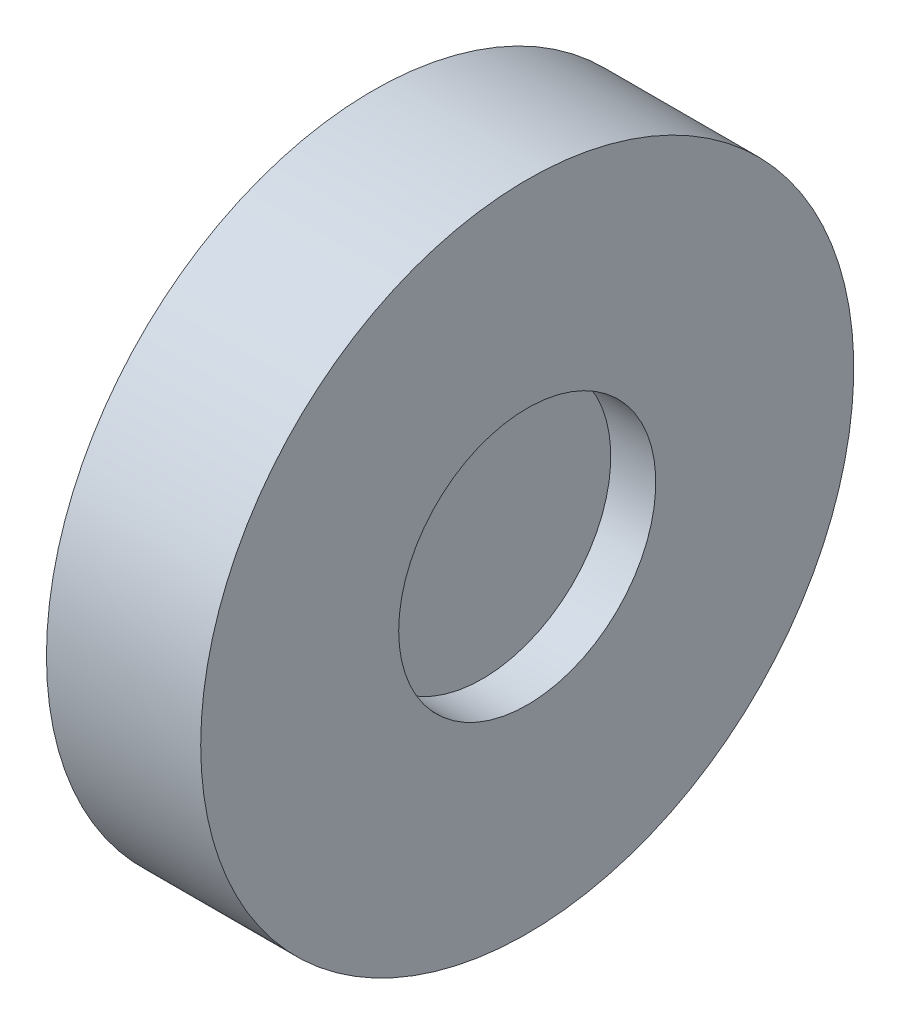
ISO-10303-21;
HEADER;
FILE_DESCRIPTION(('STEP AP214'),'2;1');
FILE_NAME('part.step','',(''),(''),'','','');
FILE_SCHEMA(('AUTOMOTIVE_DESIGN { 1 0 10303 214 1 1 1 1 }'));
ENDSEC;
DATA;
#1=APPLICATION_CONTEXT('core data for automotive mechanical design processes');
#2=APPLICATION_PROTOCOL_DEFINITION('international standard','automotive_design',2000,#1);
#3=PRODUCT_CONTEXT('',#1,'mechanical');
#4=PRODUCT('Part','Part','',(#3));
#5=PRODUCT_RELATED_PRODUCT_CATEGORY('part','',(#4));
#6=PRODUCT_DEFINITION_FORMATION('','',#4);
#7=PRODUCT_DEFINITION_CONTEXT('part definition',#1,'design');
#8=PRODUCT_DEFINITION('design','',#6,#7);
#9=PRODUCT_DEFINITION_SHAPE('','',#8);
#10=(LENGTH_UNIT() NAMED_UNIT(*) SI_UNIT(.MILLI.,.METRE.));
#11=(NAMED_UNIT(*) PLANE_ANGLE_UNIT() SI_UNIT($,.RADIAN.));
#12=(NAMED_UNIT(*) SI_UNIT($,.STERADIAN.) SOLID_ANGLE_UNIT());
#13=UNCERTAINTY_MEASURE_WITH_UNIT(LENGTH_MEASURE(1.E-05),#10,'distance_accuracy_value','');
#14=(GEOMETRIC_REPRESENTATION_CONTEXT(3) GLOBAL_UNCERTAINTY_ASSIGNED_CONTEXT((#13)) GLOBAL_UNIT_ASSIGNED_CONTEXT((#10,
#11,#12)) REPRESENTATION_CONTEXT('',''));
#15=CARTESIAN_POINT('',(0.,0.,0.));
#16=DIRECTION('',(0.,0.,1.));
#17=DIRECTION('',(1.,0.,0.));
#18=AXIS2_PLACEMENT_3D('',#15,#16,#17);
#19=CARTESIAN_POINT('',(1.25,5.,0.));
#20=DIRECTION('',(-1.,0.,0.));
#21=DIRECTION('',(0.,0.,1.));
#22=AXIS2_PLACEMENT_3D('',#19,#20,#21);
#23=PLANE('',#22);
#24=CARTESIAN_POINT('',(1.25,0.,0.));
#25=DIRECTION('',(-1.,0.,0.));
#26=DIRECTION('',(0.,0.,1.));
#27=AXIS2_PLACEMENT_3D('',#24,#25,#26);
#28=CIRCLE('',#27,5.);
#29=CARTESIAN_POINT('',(1.25,0.,5.));
#30=VERTEX_POINT('',#29);
#31=EDGE_CURVE('E10',#30,#30,#28,.T.);
#32=ORIENTED_EDGE('',*,*,#31,.F.);
#33=EDGE_LOOP('',(#32));
#34=FACE_BOUND('',#33,.T.);
#35=ADVANCED_FACE('F37',(#34),#23,.F.);
#36=CARTESIAN_POINT('',(-1.61421241885762,0.,0.));
#37=DIRECTION('',(-1.,0.,0.));
#38=DIRECTION('',(0.,0.,1.));
#39=AXIS2_PLACEMENT_3D('',#36,#37,#38);
#40=CYLINDRICAL_SURFACE('',#39,5.);
#41=CARTESIAN_POINT('',(3.,0.,0.));
#42=DIRECTION('',(-1.,0.,0.));
#43=DIRECTION('',(0.,0.,1.));
#44=AXIS2_PLACEMENT_3D('',#41,#42,#43);
#45=CIRCLE('',#44,5.);
#46=CARTESIAN_POINT('',(3.,0.,5.));
#47=VERTEX_POINT('',#46);
#48=EDGE_CURVE('E60',#47,#47,#45,.T.);
#49=ORIENTED_EDGE('',*,*,#48,.F.);
#50=EDGE_LOOP('',(#49));
#51=FACE_BOUND('',#50,.T.);
#52=ORIENTED_EDGE('',*,*,#31,.T.);
#53=EDGE_LOOP('',(#52));
#54=FACE_BOUND('',#53,.T.);
#55=ADVANCED_FACE('F90',(#51,#54),#40,.F.);
#56=CARTESIAN_POINT('',(-3.,0.,0.));
#57=DIRECTION('',(-1.,0.,0.));
#58=DIRECTION('',(0.,0.,1.));
#59=AXIS2_PLACEMENT_3D('',#56,#57,#58);
#60=CIRCLE('',#59,5.);
#61=CARTESIAN_POINT('',(-3.,0.,5.));
#62=VERTEX_POINT('',#61);
#63=EDGE_CURVE('E64',#62,#62,#60,.T.);
#64=ORIENTED_EDGE('',*,*,#63,.T.);
#65=EDGE_LOOP('',(#64));
#66=FACE_BOUND('',#65,.T.);
#67=CARTESIAN_POINT('',(-1.25,0.,0.));
#68=DIRECTION('',(1.,0.,0.));
#69=DIRECTION('',(0.,0.,-1.));
#70=AXIS2_PLACEMENT_3D('',#67,#68,#69);
#71=CIRCLE('',#70,5.);
#72=CARTESIAN_POINT('',(-1.25,0.,-5.));
#73=VERTEX_POINT('',#72);
#74=EDGE_CURVE('E44',#73,#73,#71,.T.);
#75=ORIENTED_EDGE('',*,*,#74,.T.);
#76=EDGE_LOOP('',(#75));
#77=FACE_BOUND('',#76,.T.);
#78=ADVANCED_FACE('F69',(#66,#77),#40,.F.);
#79=CARTESIAN_POINT('',(-3.,5.,0.));
#80=DIRECTION('',(1.,0.,0.));
#81=DIRECTION('',(0.,0.,-1.));
#82=AXIS2_PLACEMENT_3D('',#79,#80,#81);
#83=PLANE('',#82);
#84=ORIENTED_EDGE('',*,*,#63,.F.);
#85=EDGE_LOOP('',(#84));
#86=FACE_BOUND('',#85,.T.);
#87=CARTESIAN_POINT('',(-3.,0.,0.));
#88=DIRECTION('',(-1.,0.,0.));
#89=DIRECTION('',(0.,0.,1.));
#90=AXIS2_PLACEMENT_3D('',#87,#88,#89);
#91=CIRCLE('',#90,12.7);
#92=CARTESIAN_POINT('',(-3.,0.,12.7));
#93=VERTEX_POINT('',#92);
#94=EDGE_CURVE('E49',#93,#93,#91,.T.);
#95=ORIENTED_EDGE('',*,*,#94,.T.);
#96=EDGE_LOOP('',(#95));
#97=FACE_BOUND('',#96,.T.);
#98=ADVANCED_FACE('F71',(#86,#97),#83,.F.);
#99=CARTESIAN_POINT('',(-1.61421241885762,0.,0.));
#100=DIRECTION('',(-1.,0.,0.));
#101=DIRECTION('',(0.,0.,1.));
#102=AXIS2_PLACEMENT_3D('',#99,#100,#101);
#103=CYLINDRICAL_SURFACE('',#102,12.7);
#104=ORIENTED_EDGE('',*,*,#94,.F.);
#105=EDGE_LOOP('',(#104));
#106=FACE_BOUND('',#105,.T.);
#107=CARTESIAN_POINT('',(3.,0.,0.));
#108=DIRECTION('',(-1.,0.,0.));
#109=DIRECTION('',(0.,0.,1.));
#110=AXIS2_PLACEMENT_3D('',#107,#108,#109);
#111=CIRCLE('',#110,12.7);
#112=CARTESIAN_POINT('',(3.,0.,12.7));
#113=VERTEX_POINT('',#112);
#114=EDGE_CURVE('E54',#113,#113,#111,.T.);
#115=ORIENTED_EDGE('',*,*,#114,.T.);
#116=EDGE_LOOP('',(#115));
#117=FACE_BOUND('',#116,.T.);
#118=ADVANCED_FACE('F74',(#106,#117),#103,.T.);
#119=CARTESIAN_POINT('',(3.,12.7,0.));
#120=DIRECTION('',(-1.,0.,0.));
#121=DIRECTION('',(0.,0.,1.));
#122=AXIS2_PLACEMENT_3D('',#119,#120,#121);
#123=PLANE('',#122);
#124=ORIENTED_EDGE('',*,*,#114,.F.);
#125=EDGE_LOOP('',(#124));
#126=FACE_BOUND('',#125,.T.);
#127=ORIENTED_EDGE('',*,*,#48,.T.);
#128=EDGE_LOOP('',(#127));
#129=FACE_BOUND('',#128,.T.);
#130=ADVANCED_FACE('F80',(#126,#129),#123,.F.);
#131=CARTESIAN_POINT('',(-1.25,5.,0.));
#132=DIRECTION('',(1.,0.,0.));
#133=DIRECTION('',(0.,0.,-1.));
#134=AXIS2_PLACEMENT_3D('',#131,#132,#133);
#135=PLANE('',#134);
#136=ORIENTED_EDGE('',*,*,#74,.F.);
#137=EDGE_LOOP('',(#136));
#138=FACE_BOUND('',#137,.T.);
#139=ADVANCED_FACE('F86',(#138),#135,.F.);
#140=CLOSED_SHELL('',(#35,#55,#78,#98,#118,#130,#139));
#141=MANIFOLD_SOLID_BREP('B2',#140);
#142=ADVANCED_BREP_SHAPE_REPRESENTATION('',(#18,#141),#14);
#143=SHAPE_DEFINITION_REPRESENTATION(#9,#142);
ENDSEC;
END-ISO-10303-21;
